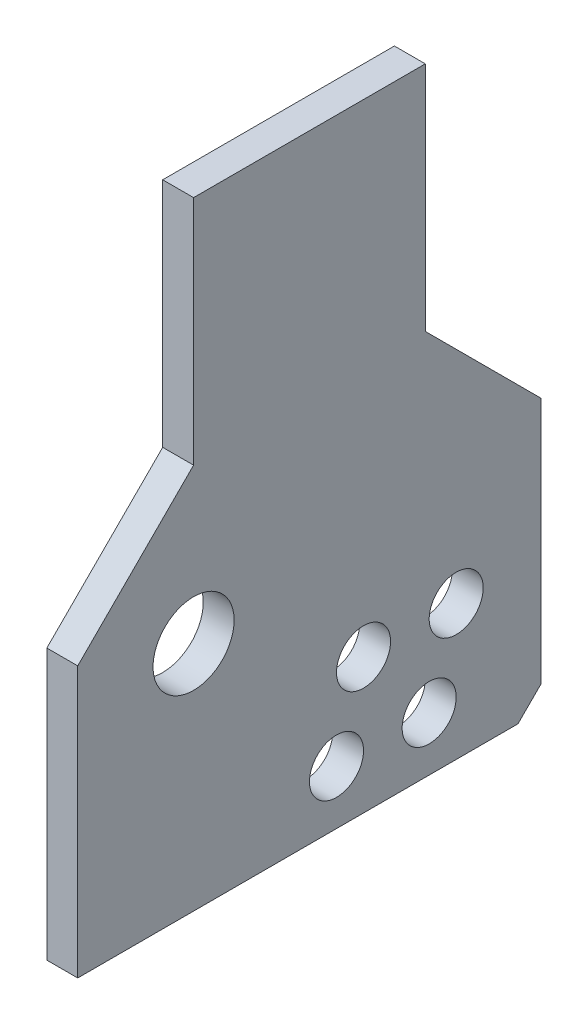
ISO-10303-21;
HEADER;
FILE_DESCRIPTION(('STEP AP214'),'2;1');
FILE_NAME('part.step','',(''),(''),'','','');
FILE_SCHEMA(('AUTOMOTIVE_DESIGN { 1 0 10303 214 1 1 1 1 }'));
ENDSEC;
DATA;
#1=APPLICATION_CONTEXT('core data for automotive mechanical design processes');
#2=APPLICATION_PROTOCOL_DEFINITION('international standard','automotive_design',2000,#1);
#3=PRODUCT_CONTEXT('',#1,'mechanical');
#4=PRODUCT('Part','Part','',(#3));
#5=PRODUCT_RELATED_PRODUCT_CATEGORY('part','',(#4));
#6=PRODUCT_DEFINITION_FORMATION('','',#4);
#7=PRODUCT_DEFINITION_CONTEXT('part definition',#1,'design');
#8=PRODUCT_DEFINITION('design','',#6,#7);
#9=PRODUCT_DEFINITION_SHAPE('','',#8);
#10=(LENGTH_UNIT() NAMED_UNIT(*) SI_UNIT(.MILLI.,.METRE.));
#11=(NAMED_UNIT(*) PLANE_ANGLE_UNIT() SI_UNIT($,.RADIAN.));
#12=(NAMED_UNIT(*) SI_UNIT($,.STERADIAN.) SOLID_ANGLE_UNIT());
#13=UNCERTAINTY_MEASURE_WITH_UNIT(LENGTH_MEASURE(1.E-05),#10,'distance_accuracy_value','');
#14=(GEOMETRIC_REPRESENTATION_CONTEXT(3) GLOBAL_UNCERTAINTY_ASSIGNED_CONTEXT((#13)) GLOBAL_UNIT_ASSIGNED_CONTEXT((#10,
#11,#12)) REPRESENTATION_CONTEXT('',''));
#15=CARTESIAN_POINT('',(0.,0.,0.));
#16=DIRECTION('',(0.,0.,1.));
#17=DIRECTION('',(1.,0.,0.));
#18=AXIS2_PLACEMENT_3D('',#15,#16,#17);
#19=CARTESIAN_POINT('',(9.00000000000005,0.,15.));
#20=DIRECTION('',(0.,0.,-1.));
#21=DIRECTION('',(-1.,0.,0.));
#22=AXIS2_PLACEMENT_3D('',#19,#20,#21);
#23=PLANE('',#22);
#24=DIRECTION('',(0.,-1.,0.));
#25=VECTOR('',#24,1.);
#26=CARTESIAN_POINT('',(5.00000000000005,0.,15.));
#27=LINE('',#26,#25);
#28=CARTESIAN_POINT('',(5.00000000000005,30.,15.));
#29=VERTEX_POINT('',#28);
#30=CARTESIAN_POINT('',(5.00000000000005,0.,15.));
#31=VERTEX_POINT('',#30);
#32=EDGE_CURVE('E142',#29,#31,#27,.T.);
#33=ORIENTED_EDGE('',*,*,#32,.T.);
#34=DIRECTION('',(-1.,0.,0.));
#35=VECTOR('',#34,1.);
#36=CARTESIAN_POINT('',(9.00000000000005,0.,15.));
#37=LINE('',#36,#35);
#38=CARTESIAN_POINT('',(9.00000000000005,0.,15.));
#39=VERTEX_POINT('',#38);
#40=EDGE_CURVE('E121',#39,#31,#37,.T.);
#41=ORIENTED_EDGE('',*,*,#40,.F.);
#42=DIRECTION('',(0.,-1.,0.));
#43=VECTOR('',#42,1.);
#44=CARTESIAN_POINT('',(9.00000000000005,0.,15.));
#45=LINE('',#44,#43);
#46=CARTESIAN_POINT('',(9.00000000000005,30.,15.));
#47=VERTEX_POINT('',#46);
#48=EDGE_CURVE('E129',#47,#39,#45,.T.);
#49=ORIENTED_EDGE('',*,*,#48,.F.);
#50=DIRECTION('',(-1.,0.,0.));
#51=VECTOR('',#50,1.);
#52=CARTESIAN_POINT('',(9.00000000000005,30.,15.));
#53=LINE('',#52,#51);
#54=EDGE_CURVE('E208',#47,#29,#53,.T.);
#55=ORIENTED_EDGE('',*,*,#54,.T.);
#56=EDGE_LOOP('',(#33,#41,#49,#55));
#57=FACE_BOUND('',#56,.T.);
#58=ADVANCED_FACE('F42',(#57),#23,.F.);
#59=CARTESIAN_POINT('',(9.0000000000001,-15.,30.));
#60=DIRECTION('',(0.,-0.707106781186548,-0.707106781186548));
#61=DIRECTION('',(0.,0.707106781186548,-0.707106781186548));
#62=AXIS2_PLACEMENT_3D('',#59,#60,#61);
#63=PLANE('',#62);
#64=DIRECTION('',(0.,-0.707106781186548,0.707106781186548));
#65=VECTOR('',#64,1.);
#66=CARTESIAN_POINT('',(5.0000000000001,-15.,30.));
#67=LINE('',#66,#65);
#68=CARTESIAN_POINT('',(5.0000000000001,-15.,30.));
#69=VERTEX_POINT('',#68);
#70=EDGE_CURVE('E183',#31,#69,#67,.T.);
#71=ORIENTED_EDGE('',*,*,#70,.T.);
#72=DIRECTION('',(-1.,0.,0.));
#73=VECTOR('',#72,1.);
#74=CARTESIAN_POINT('',(9.0000000000001,-15.,30.));
#75=LINE('',#74,#73);
#76=CARTESIAN_POINT('',(9.0000000000001,-15.,30.));
#77=VERTEX_POINT('',#76);
#78=EDGE_CURVE('E124',#77,#69,#75,.T.);
#79=ORIENTED_EDGE('',*,*,#78,.F.);
#80=DIRECTION('',(0.,-0.707106781186548,0.707106781186548));
#81=VECTOR('',#80,1.);
#82=CARTESIAN_POINT('',(9.0000000000001,-15.,30.));
#83=LINE('',#82,#81);
#84=EDGE_CURVE('E117',#39,#77,#83,.T.);
#85=ORIENTED_EDGE('',*,*,#84,.F.);
#86=ORIENTED_EDGE('',*,*,#40,.T.);
#87=EDGE_LOOP('',(#71,#79,#85,#86));
#88=FACE_BOUND('',#87,.T.);
#89=ADVANCED_FACE('F119',(#88),#63,.F.);
#90=CARTESIAN_POINT('',(9.0000000000001,-50.,30.));
#91=DIRECTION('',(0.,0.,-1.));
#92=DIRECTION('',(-1.,0.,0.));
#93=AXIS2_PLACEMENT_3D('',#90,#91,#92);
#94=PLANE('',#93);
#95=DIRECTION('',(0.,-1.,0.));
#96=VECTOR('',#95,1.);
#97=CARTESIAN_POINT('',(5.0000000000001,-50.,30.));
#98=LINE('',#97,#96);
#99=CARTESIAN_POINT('',(5.0000000000001,-50.,30.));
#100=VERTEX_POINT('',#99);
#101=EDGE_CURVE('E187',#69,#100,#98,.T.);
#102=ORIENTED_EDGE('',*,*,#101,.T.);
#103=DIRECTION('',(-1.,0.,0.));
#104=VECTOR('',#103,1.);
#105=CARTESIAN_POINT('',(9.0000000000001,-50.,30.));
#106=LINE('',#105,#104);
#107=CARTESIAN_POINT('',(9.0000000000001,-50.,30.));
#108=VERTEX_POINT('',#107);
#109=EDGE_CURVE('E151',#108,#100,#106,.T.);
#110=ORIENTED_EDGE('',*,*,#109,.F.);
#111=DIRECTION('',(0.,-1.,0.));
#112=VECTOR('',#111,1.);
#113=CARTESIAN_POINT('',(9.0000000000001,-50.,30.));
#114=LINE('',#113,#112);
#115=EDGE_CURVE('E128',#77,#108,#114,.T.);
#116=ORIENTED_EDGE('',*,*,#115,.F.);
#117=ORIENTED_EDGE('',*,*,#78,.T.);
#118=EDGE_LOOP('',(#102,#110,#116,#117));
#119=FACE_BOUND('',#118,.T.);
#120=ADVANCED_FACE('F232',(#119),#94,.F.);
#121=CARTESIAN_POINT('',(8.9999999999999,-50.,-30.0000000000001));
#122=DIRECTION('',(0.,1.,0.));
#123=DIRECTION('',(0.,0.,1.));
#124=AXIS2_PLACEMENT_3D('',#121,#122,#123);
#125=PLANE('',#124);
#126=DIRECTION('',(0.,0.,-1.));
#127=VECTOR('',#126,1.);
#128=CARTESIAN_POINT('',(4.9999999999999,-50.,-30.));
#129=LINE('',#128,#127);
#130=CARTESIAN_POINT('',(4.99999999999991,-50.,-27.));
#131=VERTEX_POINT('',#130);
#132=EDGE_CURVE('E194',#100,#131,#129,.T.);
#133=ORIENTED_EDGE('',*,*,#132,.T.);
#134=DIRECTION('',(1.,0.,0.));
#135=VECTOR('',#134,1.);
#136=CARTESIAN_POINT('',(8.99999999999991,-50.,-27.));
#137=LINE('',#136,#135);
#138=CARTESIAN_POINT('',(8.99999999999991,-50.,-27.));
#139=VERTEX_POINT('',#138);
#140=EDGE_CURVE('E53',#131,#139,#137,.T.);
#141=ORIENTED_EDGE('',*,*,#140,.T.);
#142=DIRECTION('',(0.,0.,-1.));
#143=VECTOR('',#142,1.);
#144=CARTESIAN_POINT('',(8.9999999999999,-50.,-30.0000000000001));
#145=LINE('',#144,#143);
#146=EDGE_CURVE('E228',#108,#139,#145,.T.);
#147=ORIENTED_EDGE('',*,*,#146,.F.);
#148=ORIENTED_EDGE('',*,*,#109,.T.);
#149=EDGE_LOOP('',(#133,#141,#147,#148));
#150=FACE_BOUND('',#149,.T.);
#151=ADVANCED_FACE('F227',(#150),#125,.F.);
#152=CARTESIAN_POINT('',(8.9999999999999,-15.,-30.0000000000001));
#153=DIRECTION('',(0.,0.,1.));
#154=DIRECTION('',(1.,0.,0.));
#155=AXIS2_PLACEMENT_3D('',#152,#153,#154);
#156=PLANE('',#155);
#157=DIRECTION('',(0.,1.,0.));
#158=VECTOR('',#157,1.);
#159=CARTESIAN_POINT('',(8.9999999999999,-15.,-30.0000000000001));
#160=LINE('',#159,#158);
#161=CARTESIAN_POINT('',(8.9999999999999,-47.,-30.0000000000001));
#162=VERTEX_POINT('',#161);
#163=CARTESIAN_POINT('',(8.9999999999999,-15.,-30.0000000000001));
#164=VERTEX_POINT('',#163);
#165=EDGE_CURVE('E236',#162,#164,#160,.T.);
#166=ORIENTED_EDGE('',*,*,#165,.F.);
#167=DIRECTION('',(-1.,0.,0.));
#168=VECTOR('',#167,1.);
#169=CARTESIAN_POINT('',(8.9999999999999,-47.,-30.0000000000001));
#170=LINE('',#169,#168);
#171=CARTESIAN_POINT('',(4.9999999999999,-47.,-30.0000000000001));
#172=VERTEX_POINT('',#171);
#173=EDGE_CURVE('E144',#162,#172,#170,.T.);
#174=ORIENTED_EDGE('',*,*,#173,.T.);
#175=DIRECTION('',(0.,1.,0.));
#176=VECTOR('',#175,1.);
#177=CARTESIAN_POINT('',(4.9999999999999,-15.,-30.));
#178=LINE('',#177,#176);
#179=CARTESIAN_POINT('',(4.9999999999999,-15.,-30.));
#180=VERTEX_POINT('',#179);
#181=EDGE_CURVE('E197',#172,#180,#178,.T.);
#182=ORIENTED_EDGE('',*,*,#181,.T.);
#183=DIRECTION('',(-1.,0.,0.));
#184=VECTOR('',#183,1.);
#185=CARTESIAN_POINT('',(8.9999999999999,-15.,-30.0000000000001));
#186=LINE('',#185,#184);
#187=EDGE_CURVE('E219',#164,#180,#186,.T.);
#188=ORIENTED_EDGE('',*,*,#187,.F.);
#189=EDGE_LOOP('',(#166,#174,#182,#188));
#190=FACE_BOUND('',#189,.T.);
#191=ADVANCED_FACE('F304',(#190),#156,.F.);
#192=CARTESIAN_POINT('',(8.99999999999995,0.,-15.));
#193=DIRECTION('',(0.,-0.707106781186548,0.707106781186548));
#194=DIRECTION('',(0.,-0.707106781186548,-0.707106781186548));
#195=AXIS2_PLACEMENT_3D('',#192,#193,#194);
#196=PLANE('',#195);
#197=DIRECTION('',(0.,0.707106781186548,0.707106781186548));
#198=VECTOR('',#197,1.);
#199=CARTESIAN_POINT('',(4.99999999999995,0.,-15.));
#200=LINE('',#199,#198);
#201=CARTESIAN_POINT('',(4.99999999999995,0.,-15.));
#202=VERTEX_POINT('',#201);
#203=EDGE_CURVE('E200',#180,#202,#200,.T.);
#204=ORIENTED_EDGE('',*,*,#203,.T.);
#205=DIRECTION('',(-1.,0.,0.));
#206=VECTOR('',#205,1.);
#207=CARTESIAN_POINT('',(8.99999999999995,0.,-15.));
#208=LINE('',#207,#206);
#209=CARTESIAN_POINT('',(8.99999999999995,0.,-15.));
#210=VERTEX_POINT('',#209);
#211=EDGE_CURVE('E215',#210,#202,#208,.T.);
#212=ORIENTED_EDGE('',*,*,#211,.F.);
#213=DIRECTION('',(0.,0.707106781186548,0.707106781186548));
#214=VECTOR('',#213,1.);
#215=CARTESIAN_POINT('',(8.99999999999995,0.,-15.));
#216=LINE('',#215,#214);
#217=EDGE_CURVE('E241',#164,#210,#216,.T.);
#218=ORIENTED_EDGE('',*,*,#217,.F.);
#219=ORIENTED_EDGE('',*,*,#187,.T.);
#220=EDGE_LOOP('',(#204,#212,#218,#219));
#221=FACE_BOUND('',#220,.T.);
#222=ADVANCED_FACE('F307',(#221),#196,.F.);
#223=CARTESIAN_POINT('',(8.99999999999995,30.,-15.));
#224=DIRECTION('',(0.,0.,1.));
#225=DIRECTION('',(1.,0.,0.));
#226=AXIS2_PLACEMENT_3D('',#223,#224,#225);
#227=PLANE('',#226);
#228=DIRECTION('',(0.,1.,0.));
#229=VECTOR('',#228,1.);
#230=CARTESIAN_POINT('',(4.99999999999995,30.,-15.));
#231=LINE('',#230,#229);
#232=CARTESIAN_POINT('',(4.99999999999995,30.,-15.));
#233=VERTEX_POINT('',#232);
#234=EDGE_CURVE('E203',#202,#233,#231,.T.);
#235=ORIENTED_EDGE('',*,*,#234,.T.);
#236=DIRECTION('',(-1.,0.,0.));
#237=VECTOR('',#236,1.);
#238=CARTESIAN_POINT('',(8.99999999999995,30.,-15.));
#239=LINE('',#238,#237);
#240=CARTESIAN_POINT('',(8.99999999999995,30.,-15.));
#241=VERTEX_POINT('',#240);
#242=EDGE_CURVE('E211',#241,#233,#239,.T.);
#243=ORIENTED_EDGE('',*,*,#242,.F.);
#244=DIRECTION('',(0.,1.,0.));
#245=VECTOR('',#244,1.);
#246=CARTESIAN_POINT('',(8.99999999999995,30.,-15.));
#247=LINE('',#246,#245);
#248=EDGE_CURVE('E243',#210,#241,#247,.T.);
#249=ORIENTED_EDGE('',*,*,#248,.F.);
#250=ORIENTED_EDGE('',*,*,#211,.T.);
#251=EDGE_LOOP('',(#235,#243,#249,#250));
#252=FACE_BOUND('',#251,.T.);
#253=ADVANCED_FACE('F288',(#252),#227,.F.);
#254=CARTESIAN_POINT('',(9.00000000000005,30.,15.));
#255=DIRECTION('',(0.,-1.,0.));
#256=DIRECTION('',(0.,0.,-1.));
#257=AXIS2_PLACEMENT_3D('',#254,#255,#256);
#258=PLANE('',#257);
#259=DIRECTION('',(0.,0.,1.));
#260=VECTOR('',#259,1.);
#261=CARTESIAN_POINT('',(5.00000000000005,30.,15.));
#262=LINE('',#261,#260);
#263=EDGE_CURVE('E139',#233,#29,#262,.T.);
#264=ORIENTED_EDGE('',*,*,#263,.T.);
#265=ORIENTED_EDGE('',*,*,#54,.F.);
#266=DIRECTION('',(0.,0.,1.));
#267=VECTOR('',#266,1.);
#268=CARTESIAN_POINT('',(9.00000000000005,30.,15.));
#269=LINE('',#268,#267);
#270=EDGE_CURVE('E134',#241,#47,#269,.T.);
#271=ORIENTED_EDGE('',*,*,#270,.F.);
#272=ORIENTED_EDGE('',*,*,#242,.T.);
#273=EDGE_LOOP('',(#264,#265,#271,#272));
#274=FACE_BOUND('',#273,.T.);
#275=ADVANCED_FACE('F279',(#274),#258,.F.);
#276=CARTESIAN_POINT('',(9.,0.,0.));
#277=DIRECTION('',(-1.,0.,0.));
#278=DIRECTION('',(0.,0.,1.));
#279=AXIS2_PLACEMENT_3D('',#276,#277,#278);
#280=PLANE('',#279);
#281=CARTESIAN_POINT('',(9.00000000000005,-20.,15.0000000000005));
#282=DIRECTION('',(1.,0.,0.));
#283=DIRECTION('',(0.,0.,-1.));
#284=AXIS2_PLACEMENT_3D('',#281,#282,#283);
#285=CIRCLE('',#284,5.25);
#286=CARTESIAN_POINT('',(9.00000000000003,-20.,9.75000000000046));
#287=VERTEX_POINT('',#286);
#288=EDGE_CURVE('E164',#287,#287,#285,.T.);
#289=ORIENTED_EDGE('',*,*,#288,.F.);
#290=EDGE_LOOP('',(#289));
#291=FACE_BOUND('',#290,.T.);
#292=CARTESIAN_POINT('',(8.99999999999999,-43.,-3.49999999999938));
#293=DIRECTION('',(1.,0.,0.));
#294=DIRECTION('',(0.,0.,-1.));
#295=AXIS2_PLACEMENT_3D('',#292,#293,#294);
#296=CIRCLE('',#295,3.49999999999996);
#297=CARTESIAN_POINT('',(8.99999999999998,-43.,-6.99999999999934));
#298=VERTEX_POINT('',#297);
#299=EDGE_CURVE('E254',#298,#298,#296,.T.);
#300=ORIENTED_EDGE('',*,*,#299,.F.);
#301=EDGE_LOOP('',(#300));
#302=FACE_BOUND('',#301,.T.);
#303=CARTESIAN_POINT('',(8.99999999999995,-43.,-15.4999999999996));
#304=DIRECTION('',(1.,0.,0.));
#305=DIRECTION('',(0.,0.,-1.));
#306=AXIS2_PLACEMENT_3D('',#303,#304,#305);
#307=CIRCLE('',#306,3.5);
#308=CARTESIAN_POINT('',(8.99999999999993,-43.,-18.9999999999996));
#309=VERTEX_POINT('',#308);
#310=EDGE_CURVE('E259',#309,#309,#307,.T.);
#311=ORIENTED_EDGE('',*,*,#310,.F.);
#312=EDGE_LOOP('',(#311));
#313=FACE_BOUND('',#312,.T.);
#314=CARTESIAN_POINT('',(8.99999999999998,-32.5,-6.99999999999956));
#315=DIRECTION('',(1.,0.,0.));
#316=DIRECTION('',(0.,0.,-1.));
#317=AXIS2_PLACEMENT_3D('',#314,#315,#316);
#318=CIRCLE('',#317,3.5);
#319=CARTESIAN_POINT('',(8.99999999999996,-32.5,-10.4999999999996));
#320=VERTEX_POINT('',#319);
#321=EDGE_CURVE('E264',#320,#320,#318,.T.);
#322=ORIENTED_EDGE('',*,*,#321,.F.);
#323=EDGE_LOOP('',(#322));
#324=FACE_BOUND('',#323,.T.);
#325=CARTESIAN_POINT('',(8.99999999999993,-32.5,-18.9999999999996));
#326=DIRECTION('',(1.,0.,0.));
#327=DIRECTION('',(0.,0.,-1.));
#328=AXIS2_PLACEMENT_3D('',#325,#326,#327);
#329=CIRCLE('',#328,3.5);
#330=CARTESIAN_POINT('',(8.99999999999992,-32.5,-22.4999999999996));
#331=VERTEX_POINT('',#330);
#332=EDGE_CURVE('E269',#331,#331,#329,.T.);
#333=ORIENTED_EDGE('',*,*,#332,.F.);
#334=EDGE_LOOP('',(#333));
#335=FACE_BOUND('',#334,.T.);
#336=ORIENTED_EDGE('',*,*,#146,.T.);
#337=DIRECTION('',(0.,-0.707106781186546,0.70710678118655));
#338=VECTOR('',#337,1.);
#339=CARTESIAN_POINT('',(8.9999999999999,-47.,-30.0000000000001));
#340=LINE('',#339,#338);
#341=EDGE_CURVE('E11',#139,#162,#340,.F.);
#342=ORIENTED_EDGE('',*,*,#341,.T.);
#343=ORIENTED_EDGE('',*,*,#165,.T.);
#344=ORIENTED_EDGE('',*,*,#217,.T.);
#345=ORIENTED_EDGE('',*,*,#248,.T.);
#346=ORIENTED_EDGE('',*,*,#270,.T.);
#347=ORIENTED_EDGE('',*,*,#48,.T.);
#348=ORIENTED_EDGE('',*,*,#84,.T.);
#349=ORIENTED_EDGE('',*,*,#115,.T.);
#350=EDGE_LOOP('',(#336,#342,#343,#344,#345,#346,#347,#348,#349));
#351=FACE_BOUND('',#350,.T.);
#352=ADVANCED_FACE('F132',(#291,#302,#313,#324,#335,#351),#280,.F.);
#353=CARTESIAN_POINT('',(5.,0.,0.));
#354=DIRECTION('',(-1.,0.,0.));
#355=DIRECTION('',(0.,0.,1.));
#356=AXIS2_PLACEMENT_3D('',#353,#354,#355);
#357=PLANE('',#356);
#358=CARTESIAN_POINT('',(5.00000000000005,-20.,15.0000000000005));
#359=DIRECTION('',(-1.,0.,0.));
#360=DIRECTION('',(0.,0.,1.));
#361=AXIS2_PLACEMENT_3D('',#358,#359,#360);
#362=CIRCLE('',#361,5.25);
#363=CARTESIAN_POINT('',(5.00000000000007,-20.,20.2500000000005));
#364=VERTEX_POINT('',#363);
#365=EDGE_CURVE('E47',#364,#364,#362,.T.);
#366=ORIENTED_EDGE('',*,*,#365,.F.);
#367=EDGE_LOOP('',(#366));
#368=FACE_BOUND('',#367,.T.);
#369=CARTESIAN_POINT('',(4.99999999999999,-43.,-3.49999999999936));
#370=DIRECTION('',(-1.,0.,0.));
#371=DIRECTION('',(0.,0.,1.));
#372=AXIS2_PLACEMENT_3D('',#369,#370,#371);
#373=CIRCLE('',#372,3.49999999999996);
#374=CARTESIAN_POINT('',(5.,-43.,6.01081684425964E-13));
#375=VERTEX_POINT('',#374);
#376=EDGE_CURVE('E171',#375,#375,#373,.T.);
#377=ORIENTED_EDGE('',*,*,#376,.F.);
#378=EDGE_LOOP('',(#377));
#379=FACE_BOUND('',#378,.T.);
#380=CARTESIAN_POINT('',(4.99999999999995,-43.,-15.4999999999996));
#381=DIRECTION('',(-1.,0.,0.));
#382=DIRECTION('',(0.,0.,1.));
#383=AXIS2_PLACEMENT_3D('',#380,#381,#382);
#384=CIRCLE('',#383,3.5);
#385=CARTESIAN_POINT('',(4.99999999999996,-43.,-11.9999999999995));
#386=VERTEX_POINT('',#385);
#387=EDGE_CURVE('E168',#386,#386,#384,.T.);
#388=ORIENTED_EDGE('',*,*,#387,.F.);
#389=EDGE_LOOP('',(#388));
#390=FACE_BOUND('',#389,.T.);
#391=CARTESIAN_POINT('',(4.99999999999998,-32.5,-6.99999999999955));
#392=DIRECTION('',(-1.,0.,0.));
#393=DIRECTION('',(0.,0.,1.));
#394=AXIS2_PLACEMENT_3D('',#391,#392,#393);
#395=CIRCLE('',#394,3.5);
#396=CARTESIAN_POINT('',(4.99999999999999,-32.5,-3.49999999999955));
#397=VERTEX_POINT('',#396);
#398=EDGE_CURVE('E163',#397,#397,#395,.T.);
#399=ORIENTED_EDGE('',*,*,#398,.F.);
#400=EDGE_LOOP('',(#399));
#401=FACE_BOUND('',#400,.T.);
#402=CARTESIAN_POINT('',(4.99999999999994,-32.5,-18.9999999999996));
#403=DIRECTION('',(-1.,0.,0.));
#404=DIRECTION('',(0.,0.,1.));
#405=AXIS2_PLACEMENT_3D('',#402,#403,#404);
#406=CIRCLE('',#405,3.5);
#407=CARTESIAN_POINT('',(4.99999999999995,-32.5,-15.4999999999996));
#408=VERTEX_POINT('',#407);
#409=EDGE_CURVE('E159',#408,#408,#406,.T.);
#410=ORIENTED_EDGE('',*,*,#409,.F.);
#411=EDGE_LOOP('',(#410));
#412=FACE_BOUND('',#411,.T.);
#413=ORIENTED_EDGE('',*,*,#181,.F.);
#414=DIRECTION('',(0.,0.707106781186546,-0.70710678118655));
#415=VECTOR('',#414,1.);
#416=CARTESIAN_POINT('',(4.99999999999987,-38.5000000000001,-38.5));
#417=LINE('',#416,#415);
#418=EDGE_CURVE('E68',#172,#131,#417,.F.);
#419=ORIENTED_EDGE('',*,*,#418,.T.);
#420=ORIENTED_EDGE('',*,*,#132,.F.);
#421=ORIENTED_EDGE('',*,*,#101,.F.);
#422=ORIENTED_EDGE('',*,*,#70,.F.);
#423=ORIENTED_EDGE('',*,*,#32,.F.);
#424=ORIENTED_EDGE('',*,*,#263,.F.);
#425=ORIENTED_EDGE('',*,*,#234,.F.);
#426=ORIENTED_EDGE('',*,*,#203,.F.);
#427=EDGE_LOOP('',(#413,#419,#420,#421,#422,#423,#424,#425,#426));
#428=FACE_BOUND('',#427,.T.);
#429=ADVANCED_FACE('F231',(#368,#379,#390,#401,#412,#428),#357,.T.);
#430=CARTESIAN_POINT('',(8.9999999999999,-47.,-30.0000000000001));
#431=DIRECTION('',(0.,0.707106781186549,0.707106781186546));
#432=DIRECTION('',(-1.,0.,0.));
#433=AXIS2_PLACEMENT_3D('',#430,#431,#432);
#434=PLANE('',#433);
#435=ORIENTED_EDGE('',*,*,#341,.F.);
#436=ORIENTED_EDGE('',*,*,#140,.F.);
#437=ORIENTED_EDGE('',*,*,#418,.F.);
#438=ORIENTED_EDGE('',*,*,#173,.F.);
#439=EDGE_LOOP('',(#435,#436,#437,#438));
#440=FACE_BOUND('',#439,.T.);
#441=ADVANCED_FACE('F45',(#440),#434,.F.);
#442=CARTESIAN_POINT('',(-5.00000000000022,-32.5,-18.9999999999995));
#443=DIRECTION('',(1.,0.,0.));
#444=DIRECTION('',(0.,0.,-1.));
#445=AXIS2_PLACEMENT_3D('',#442,#443,#444);
#446=CYLINDRICAL_SURFACE('',#445,3.5);
#447=ORIENTED_EDGE('',*,*,#409,.T.);
#448=EDGE_LOOP('',(#447));
#449=FACE_BOUND('',#448,.T.);
#450=ORIENTED_EDGE('',*,*,#332,.T.);
#451=EDGE_LOOP('',(#450));
#452=FACE_BOUND('',#451,.T.);
#453=ADVANCED_FACE('F276',(#449,#452),#446,.F.);
#454=CARTESIAN_POINT('',(-5.00000000000018,-32.5,-6.99999999999952));
#455=DIRECTION('',(1.,0.,0.));
#456=DIRECTION('',(0.,0.,-1.));
#457=AXIS2_PLACEMENT_3D('',#454,#455,#456);
#458=CYLINDRICAL_SURFACE('',#457,3.5);
#459=ORIENTED_EDGE('',*,*,#398,.T.);
#460=EDGE_LOOP('',(#459));
#461=FACE_BOUND('',#460,.T.);
#462=ORIENTED_EDGE('',*,*,#321,.T.);
#463=EDGE_LOOP('',(#462));
#464=FACE_BOUND('',#463,.T.);
#465=ADVANCED_FACE('F330',(#461,#464),#458,.F.);
#466=CARTESIAN_POINT('',(-5.00000000000021,-43.,-15.4999999999995));
#467=DIRECTION('',(1.,0.,0.));
#468=DIRECTION('',(0.,0.,-1.));
#469=AXIS2_PLACEMENT_3D('',#466,#467,#468);
#470=CYLINDRICAL_SURFACE('',#469,3.5);
#471=ORIENTED_EDGE('',*,*,#387,.T.);
#472=EDGE_LOOP('',(#471));
#473=FACE_BOUND('',#472,.T.);
#474=ORIENTED_EDGE('',*,*,#310,.T.);
#475=EDGE_LOOP('',(#474));
#476=FACE_BOUND('',#475,.T.);
#477=ADVANCED_FACE('F335',(#473,#476),#470,.F.);
#478=CARTESIAN_POINT('',(-5.00000000000017,-43.,-3.49999999999933));
#479=DIRECTION('',(1.,0.,0.));
#480=DIRECTION('',(0.,0.,-1.));
#481=AXIS2_PLACEMENT_3D('',#478,#479,#480);
#482=CYLINDRICAL_SURFACE('',#481,3.49999999999996);
#483=ORIENTED_EDGE('',*,*,#376,.T.);
#484=EDGE_LOOP('',(#483));
#485=FACE_BOUND('',#484,.T.);
#486=ORIENTED_EDGE('',*,*,#299,.T.);
#487=EDGE_LOOP('',(#486));
#488=FACE_BOUND('',#487,.T.);
#489=ADVANCED_FACE('F341',(#485,#488),#482,.F.);
#490=CARTESIAN_POINT('',(-5.0000000000001,-20.,15.0000000000005));
#491=DIRECTION('',(1.,0.,0.));
#492=DIRECTION('',(0.,0.,-1.));
#493=AXIS2_PLACEMENT_3D('',#490,#491,#492);
#494=CYLINDRICAL_SURFACE('',#493,5.25);
#495=ORIENTED_EDGE('',*,*,#365,.T.);
#496=EDGE_LOOP('',(#495));
#497=FACE_BOUND('',#496,.T.);
#498=ORIENTED_EDGE('',*,*,#288,.T.);
#499=EDGE_LOOP('',(#498));
#500=FACE_BOUND('',#499,.T.);
#501=ADVANCED_FACE('F345',(#497,#500),#494,.F.);
#502=CLOSED_SHELL('',(#58,#89,#120,#151,#191,#222,#253,#275,#352,#429,#441,#453,#465,#477,#489,#501));
#503=MANIFOLD_SOLID_BREP('B2',#502);
#504=ADVANCED_BREP_SHAPE_REPRESENTATION('',(#18,#503),#14);
#505=SHAPE_DEFINITION_REPRESENTATION(#9,#504);
ENDSEC;
END-ISO-10303-21;
